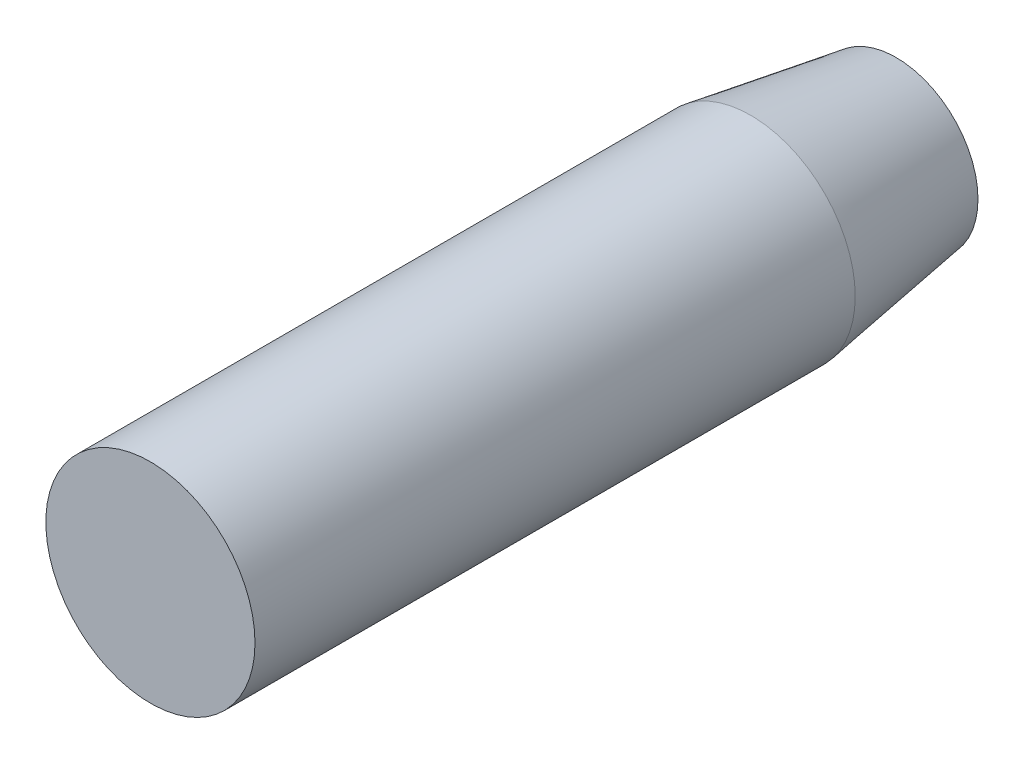
ISO-10303-21;
HEADER;
FILE_DESCRIPTION(('STEP AP214'),'2;1');
FILE_NAME('part.step','',(''),(''),'','','');
FILE_SCHEMA(('AUTOMOTIVE_DESIGN { 1 0 10303 214 1 1 1 1 }'));
ENDSEC;
DATA;
#1=APPLICATION_CONTEXT('core data for automotive mechanical design processes');
#2=APPLICATION_PROTOCOL_DEFINITION('international standard','automotive_design',2000,#1);
#3=PRODUCT_CONTEXT('',#1,'mechanical');
#4=PRODUCT('Part','Part','',(#3));
#5=PRODUCT_RELATED_PRODUCT_CATEGORY('part','',(#4));
#6=PRODUCT_DEFINITION_FORMATION('','',#4);
#7=PRODUCT_DEFINITION_CONTEXT('part definition',#1,'design');
#8=PRODUCT_DEFINITION('design','',#6,#7);
#9=PRODUCT_DEFINITION_SHAPE('','',#8);
#10=(LENGTH_UNIT() NAMED_UNIT(*) SI_UNIT(.MILLI.,.METRE.));
#11=(NAMED_UNIT(*) PLANE_ANGLE_UNIT() SI_UNIT($,.RADIAN.));
#12=(NAMED_UNIT(*) SI_UNIT($,.STERADIAN.) SOLID_ANGLE_UNIT());
#13=UNCERTAINTY_MEASURE_WITH_UNIT(LENGTH_MEASURE(1.E-05),#10,'distance_accuracy_value','');
#14=(GEOMETRIC_REPRESENTATION_CONTEXT(3) GLOBAL_UNCERTAINTY_ASSIGNED_CONTEXT((#13)) GLOBAL_UNIT_ASSIGNED_CONTEXT((#10,
#11,#12)) REPRESENTATION_CONTEXT('',''));
#15=CARTESIAN_POINT('',(0.,0.,0.));
#16=DIRECTION('',(0.,0.,1.));
#17=DIRECTION('',(1.,0.,0.));
#18=AXIS2_PLACEMENT_3D('',#15,#16,#17);
#19=CARTESIAN_POINT('',(-4.83870960531696,12.5960053959194,0.));
#20=DIRECTION('',(0.,0.,-1.));
#21=DIRECTION('',(-1.,0.,0.));
#22=AXIS2_PLACEMENT_3D('',#19,#20,#21);
#23=PLANE('',#22);
#24=CARTESIAN_POINT('',(-4.83870960531696,12.5960053959194,2.00880978518114E-12));
#25=DIRECTION('',(0.,0.,1.));
#26=DIRECTION('',(1.,0.,0.));
#27=AXIS2_PLACEMENT_3D('',#24,#25,#26);
#28=CIRCLE('',#27,14.2874999999872);
#29=CARTESIAN_POINT('',(9.44879039467024,12.5960053959194,2.00880978518114E-12));
#30=VERTEX_POINT('',#29);
#31=EDGE_CURVE('E18',#30,#30,#28,.T.);
#32=ORIENTED_EDGE('',*,*,#31,.F.);
#33=EDGE_LOOP('',(#32));
#34=FACE_BOUND('',#33,.T.);
#35=ADVANCED_FACE('F15',(#34),#23,.T.);
#36=CARTESIAN_POINT('',(-4.83870960531696,12.5960053959194,25.4));
#37=DIRECTION('',(0.,0.,1.));
#38=DIRECTION('',(1.,0.,0.));
#39=AXIS2_PLACEMENT_3D('',#36,#37,#38);
#40=CONICAL_SURFACE('',#39,18.25625,0.154996741924445);
#41=CARTESIAN_POINT('',(-4.83870960531696,12.5960053959194,25.4));
#42=DIRECTION('',(0.,0.,1.));
#43=DIRECTION('',(1.,0.,0.));
#44=AXIS2_PLACEMENT_3D('',#41,#42,#43);
#45=CIRCLE('',#44,18.25625);
#46=CARTESIAN_POINT('',(13.417540394683,12.5960053959194,25.4));
#47=VERTEX_POINT('',#46);
#48=EDGE_CURVE('E22',#47,#47,#45,.T.);
#49=ORIENTED_EDGE('',*,*,#48,.F.);
#50=EDGE_LOOP('',(#49));
#51=FACE_BOUND('',#50,.T.);
#52=ORIENTED_EDGE('',*,*,#31,.T.);
#53=EDGE_LOOP('',(#52));
#54=FACE_BOUND('',#53,.T.);
#55=ADVANCED_FACE('F34',(#51,#54),#40,.T.);
#56=CARTESIAN_POINT('',(-4.83870960531696,12.5960053959194,130.175));
#57=DIRECTION('',(0.,0.,-1.));
#58=DIRECTION('',(-1.,0.,0.));
#59=AXIS2_PLACEMENT_3D('',#56,#57,#58);
#60=PLANE('',#59);
#61=CARTESIAN_POINT('',(-4.83870960531696,12.5960053959194,130.175));
#62=DIRECTION('',(0.,0.,1.));
#63=DIRECTION('',(1.,0.,0.));
#64=AXIS2_PLACEMENT_3D('',#61,#62,#63);
#65=CIRCLE('',#64,18.25625);
#66=CARTESIAN_POINT('',(13.417540394683,12.5960053959194,130.175));
#67=VERTEX_POINT('',#66);
#68=EDGE_CURVE('E10',#67,#67,#65,.F.);
#69=ORIENTED_EDGE('',*,*,#68,.F.);
#70=EDGE_LOOP('',(#69));
#71=FACE_BOUND('',#70,.T.);
#72=ADVANCED_FACE('F41',(#71),#60,.F.);
#73=CARTESIAN_POINT('',(-4.83870960531696,12.5960053959194,0.));
#74=DIRECTION('',(0.,0.,1.));
#75=DIRECTION('',(1.,0.,0.));
#76=AXIS2_PLACEMENT_3D('',#73,#74,#75);
#77=CYLINDRICAL_SURFACE('',#76,18.25625);
#78=ORIENTED_EDGE('',*,*,#68,.T.);
#79=EDGE_LOOP('',(#78));
#80=FACE_BOUND('',#79,.T.);
#81=ORIENTED_EDGE('',*,*,#48,.T.);
#82=EDGE_LOOP('',(#81));
#83=FACE_BOUND('',#82,.T.);
#84=ADVANCED_FACE('F43',(#80,#83),#77,.T.);
#85=CLOSED_SHELL('',(#35,#55,#72,#84));
#86=MANIFOLD_SOLID_BREP('B1',#85);
#87=ADVANCED_BREP_SHAPE_REPRESENTATION('',(#18,#86),#14);
#88=SHAPE_DEFINITION_REPRESENTATION(#9,#87);
ENDSEC;
END-ISO-10303-21;
